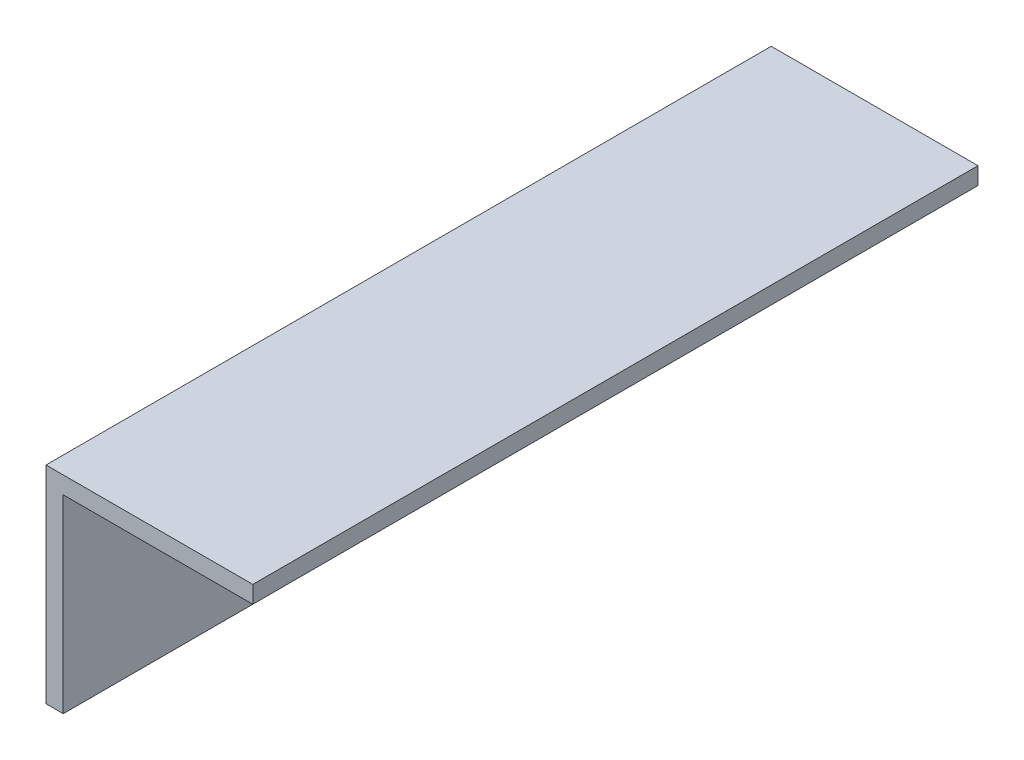
ISO-10303-21;
HEADER;
FILE_DESCRIPTION(('STEP AP214'),'2;1');
FILE_NAME('part.step','',(''),(''),'','','');
FILE_SCHEMA(('AUTOMOTIVE_DESIGN { 1 0 10303 214 1 1 1 1 }'));
ENDSEC;
DATA;
#1=APPLICATION_CONTEXT('core data for automotive mechanical design processes');
#2=APPLICATION_PROTOCOL_DEFINITION('international standard','automotive_design',2000,#1);
#3=PRODUCT_CONTEXT('',#1,'mechanical');
#4=PRODUCT('Part','Part','',(#3));
#5=PRODUCT_RELATED_PRODUCT_CATEGORY('part','',(#4));
#6=PRODUCT_DEFINITION_FORMATION('','',#4);
#7=PRODUCT_DEFINITION_CONTEXT('part definition',#1,'design');
#8=PRODUCT_DEFINITION('design','',#6,#7);
#9=PRODUCT_DEFINITION_SHAPE('','',#8);
#10=(LENGTH_UNIT() NAMED_UNIT(*) SI_UNIT(.MILLI.,.METRE.));
#11=(NAMED_UNIT(*) PLANE_ANGLE_UNIT() SI_UNIT($,.RADIAN.));
#12=(NAMED_UNIT(*) SI_UNIT($,.STERADIAN.) SOLID_ANGLE_UNIT());
#13=UNCERTAINTY_MEASURE_WITH_UNIT(LENGTH_MEASURE(1.E-05),#10,'distance_accuracy_value','');
#14=(GEOMETRIC_REPRESENTATION_CONTEXT(3) GLOBAL_UNCERTAINTY_ASSIGNED_CONTEXT((#13)) GLOBAL_UNIT_ASSIGNED_CONTEXT((#10,
#11,#12)) REPRESENTATION_CONTEXT('',''));
#15=CARTESIAN_POINT('',(0.,0.,0.));
#16=DIRECTION('',(0.,0.,1.));
#17=DIRECTION('',(1.,0.,0.));
#18=AXIS2_PLACEMENT_3D('',#15,#16,#17);
#19=CARTESIAN_POINT('',(19.05,19.05,66.802));
#20=DIRECTION('',(1.,0.,0.));
#21=DIRECTION('',(0.,0.,-1.));
#22=AXIS2_PLACEMENT_3D('',#19,#20,#21);
#23=PLANE('',#22);
#24=DIRECTION('',(0.,-1.,0.));
#25=VECTOR('',#24,1.);
#26=CARTESIAN_POINT('',(19.05,19.05,0.));
#27=LINE('',#26,#25);
#28=CARTESIAN_POINT('',(19.05,19.05,0.));
#29=VERTEX_POINT('',#28);
#30=CARTESIAN_POINT('',(19.05,17.4625,0.));
#31=VERTEX_POINT('',#30);
#32=EDGE_CURVE('E120',#29,#31,#27,.T.);
#33=ORIENTED_EDGE('',*,*,#32,.F.);
#34=DIRECTION('',(0.,0.,-1.));
#35=VECTOR('',#34,1.);
#36=CARTESIAN_POINT('',(19.05,19.05,66.802));
#37=LINE('',#36,#35);
#38=CARTESIAN_POINT('',(19.05,19.05,66.802));
#39=VERTEX_POINT('',#38);
#40=EDGE_CURVE('E11',#39,#29,#37,.T.);
#41=ORIENTED_EDGE('',*,*,#40,.F.);
#42=DIRECTION('',(0.,-1.,0.));
#43=VECTOR('',#42,1.);
#44=CARTESIAN_POINT('',(19.05,19.05,66.802));
#45=LINE('',#44,#43);
#46=CARTESIAN_POINT('',(19.05,17.4625,66.802));
#47=VERTEX_POINT('',#46);
#48=EDGE_CURVE('E134',#39,#47,#45,.T.);
#49=ORIENTED_EDGE('',*,*,#48,.T.);
#50=DIRECTION('',(0.,0.,-1.));
#51=VECTOR('',#50,1.);
#52=CARTESIAN_POINT('',(19.05,17.4625,66.802));
#53=LINE('',#52,#51);
#54=EDGE_CURVE('E38',#47,#31,#53,.T.);
#55=ORIENTED_EDGE('',*,*,#54,.T.);
#56=EDGE_LOOP('',(#33,#41,#49,#55));
#57=FACE_BOUND('',#56,.T.);
#58=ADVANCED_FACE('F35',(#57),#23,.T.);
#59=CARTESIAN_POINT('',(0.,19.05,66.802));
#60=DIRECTION('',(0.,1.,0.));
#61=DIRECTION('',(0.,0.,1.));
#62=AXIS2_PLACEMENT_3D('',#59,#60,#61);
#63=PLANE('',#62);
#64=DIRECTION('',(1.,0.,0.));
#65=VECTOR('',#64,1.);
#66=CARTESIAN_POINT('',(0.,19.05,0.));
#67=LINE('',#66,#65);
#68=CARTESIAN_POINT('',(0.,19.05,0.));
#69=VERTEX_POINT('',#68);
#70=EDGE_CURVE('E132',#69,#29,#67,.T.);
#71=ORIENTED_EDGE('',*,*,#70,.F.);
#72=DIRECTION('',(0.,0.,-1.));
#73=VECTOR('',#72,1.);
#74=CARTESIAN_POINT('',(0.,19.05,66.802));
#75=LINE('',#74,#73);
#76=CARTESIAN_POINT('',(0.,19.05,66.802));
#77=VERTEX_POINT('',#76);
#78=EDGE_CURVE('E44',#77,#69,#75,.T.);
#79=ORIENTED_EDGE('',*,*,#78,.F.);
#80=DIRECTION('',(1.,0.,0.));
#81=VECTOR('',#80,1.);
#82=CARTESIAN_POINT('',(0.,19.05,66.802));
#83=LINE('',#82,#81);
#84=EDGE_CURVE('E110',#77,#39,#83,.T.);
#85=ORIENTED_EDGE('',*,*,#84,.T.);
#86=ORIENTED_EDGE('',*,*,#40,.T.);
#87=EDGE_LOOP('',(#71,#79,#85,#86));
#88=FACE_BOUND('',#87,.T.);
#89=ADVANCED_FACE('F142',(#88),#63,.T.);
#90=CARTESIAN_POINT('',(0.,0.,66.802));
#91=DIRECTION('',(-1.,0.,0.));
#92=DIRECTION('',(0.,0.,1.));
#93=AXIS2_PLACEMENT_3D('',#90,#91,#92);
#94=PLANE('',#93);
#95=DIRECTION('',(0.,1.,0.));
#96=VECTOR('',#95,1.);
#97=CARTESIAN_POINT('',(0.,0.,0.));
#98=LINE('',#97,#96);
#99=CARTESIAN_POINT('',(0.,0.,0.));
#100=VERTEX_POINT('',#99);
#101=EDGE_CURVE('E97',#100,#69,#98,.T.);
#102=ORIENTED_EDGE('',*,*,#101,.F.);
#103=DIRECTION('',(0.,0.,-1.));
#104=VECTOR('',#103,1.);
#105=CARTESIAN_POINT('',(0.,0.,66.802));
#106=LINE('',#105,#104);
#107=CARTESIAN_POINT('',(0.,0.,66.802));
#108=VERTEX_POINT('',#107);
#109=EDGE_CURVE('E92',#108,#100,#106,.T.);
#110=ORIENTED_EDGE('',*,*,#109,.F.);
#111=DIRECTION('',(0.,1.,0.));
#112=VECTOR('',#111,1.);
#113=CARTESIAN_POINT('',(0.,0.,66.802));
#114=LINE('',#113,#112);
#115=EDGE_CURVE('E95',#108,#77,#114,.T.);
#116=ORIENTED_EDGE('',*,*,#115,.T.);
#117=ORIENTED_EDGE('',*,*,#78,.T.);
#118=EDGE_LOOP('',(#102,#110,#116,#117));
#119=FACE_BOUND('',#118,.T.);
#120=ADVANCED_FACE('F94',(#119),#94,.T.);
#121=CARTESIAN_POINT('',(1.5875,0.,66.802));
#122=DIRECTION('',(0.,-1.,0.));
#123=DIRECTION('',(0.,0.,-1.));
#124=AXIS2_PLACEMENT_3D('',#121,#122,#123);
#125=PLANE('',#124);
#126=DIRECTION('',(-1.,0.,0.));
#127=VECTOR('',#126,1.);
#128=CARTESIAN_POINT('',(1.5875,0.,0.));
#129=LINE('',#128,#127);
#130=CARTESIAN_POINT('',(1.5875,0.,0.));
#131=VERTEX_POINT('',#130);
#132=EDGE_CURVE('E129',#131,#100,#129,.T.);
#133=ORIENTED_EDGE('',*,*,#132,.F.);
#134=DIRECTION('',(0.,0.,-1.));
#135=VECTOR('',#134,1.);
#136=CARTESIAN_POINT('',(1.5875,0.,66.802));
#137=LINE('',#136,#135);
#138=CARTESIAN_POINT('',(1.5875,0.,66.802));
#139=VERTEX_POINT('',#138);
#140=EDGE_CURVE('E102',#139,#131,#137,.T.);
#141=ORIENTED_EDGE('',*,*,#140,.F.);
#142=DIRECTION('',(-1.,0.,0.));
#143=VECTOR('',#142,1.);
#144=CARTESIAN_POINT('',(1.5875,0.,66.802));
#145=LINE('',#144,#143);
#146=EDGE_CURVE('E108',#139,#108,#145,.T.);
#147=ORIENTED_EDGE('',*,*,#146,.T.);
#148=ORIENTED_EDGE('',*,*,#109,.T.);
#149=EDGE_LOOP('',(#133,#141,#147,#148));
#150=FACE_BOUND('',#149,.T.);
#151=ADVANCED_FACE('F112',(#150),#125,.T.);
#152=CARTESIAN_POINT('',(1.5875,17.4625,66.802));
#153=DIRECTION('',(1.,0.,0.));
#154=DIRECTION('',(0.,1.,0.));
#155=AXIS2_PLACEMENT_3D('',#152,#153,#154);
#156=PLANE('',#155);
#157=DIRECTION('',(0.,-1.,0.));
#158=VECTOR('',#157,1.);
#159=CARTESIAN_POINT('',(1.5875,17.4625,0.));
#160=LINE('',#159,#158);
#161=CARTESIAN_POINT('',(1.5875,17.4625,0.));
#162=VERTEX_POINT('',#161);
#163=EDGE_CURVE('E126',#162,#131,#160,.T.);
#164=ORIENTED_EDGE('',*,*,#163,.F.);
#165=DIRECTION('',(0.,0.,-1.));
#166=VECTOR('',#165,1.);
#167=CARTESIAN_POINT('',(1.5875,17.4625,66.802));
#168=LINE('',#167,#166);
#169=CARTESIAN_POINT('',(1.5875,17.4625,66.802));
#170=VERTEX_POINT('',#169);
#171=EDGE_CURVE('E137',#170,#162,#168,.T.);
#172=ORIENTED_EDGE('',*,*,#171,.F.);
#173=DIRECTION('',(0.,-1.,0.));
#174=VECTOR('',#173,1.);
#175=CARTESIAN_POINT('',(1.5875,17.4625,66.802));
#176=LINE('',#175,#174);
#177=EDGE_CURVE('E113',#170,#139,#176,.T.);
#178=ORIENTED_EDGE('',*,*,#177,.T.);
#179=ORIENTED_EDGE('',*,*,#140,.T.);
#180=EDGE_LOOP('',(#164,#172,#178,#179));
#181=FACE_BOUND('',#180,.T.);
#182=ADVANCED_FACE('F155',(#181),#156,.T.);
#183=CARTESIAN_POINT('',(19.05,17.4625,66.802));
#184=DIRECTION('',(0.,-1.,0.));
#185=DIRECTION('',(0.,0.,-1.));
#186=AXIS2_PLACEMENT_3D('',#183,#184,#185);
#187=PLANE('',#186);
#188=DIRECTION('',(-1.,0.,0.));
#189=VECTOR('',#188,1.);
#190=CARTESIAN_POINT('',(19.05,17.4625,0.));
#191=LINE('',#190,#189);
#192=EDGE_CURVE('E123',#31,#162,#191,.T.);
#193=ORIENTED_EDGE('',*,*,#192,.F.);
#194=ORIENTED_EDGE('',*,*,#54,.F.);
#195=DIRECTION('',(-1.,0.,0.));
#196=VECTOR('',#195,1.);
#197=CARTESIAN_POINT('',(19.05,17.4625,66.802));
#198=LINE('',#197,#196);
#199=EDGE_CURVE('E115',#47,#170,#198,.T.);
#200=ORIENTED_EDGE('',*,*,#199,.T.);
#201=ORIENTED_EDGE('',*,*,#171,.T.);
#202=EDGE_LOOP('',(#193,#194,#200,#201));
#203=FACE_BOUND('',#202,.T.);
#204=ADVANCED_FACE('F139',(#203),#187,.T.);
#205=CARTESIAN_POINT('',(0.,0.,66.802));
#206=DIRECTION('',(0.,0.,-1.));
#207=DIRECTION('',(-1.,0.,0.));
#208=AXIS2_PLACEMENT_3D('',#205,#206,#207);
#209=PLANE('',#208);
#210=ORIENTED_EDGE('',*,*,#48,.F.);
#211=ORIENTED_EDGE('',*,*,#84,.F.);
#212=ORIENTED_EDGE('',*,*,#115,.F.);
#213=ORIENTED_EDGE('',*,*,#146,.F.);
#214=ORIENTED_EDGE('',*,*,#177,.F.);
#215=ORIENTED_EDGE('',*,*,#199,.F.);
#216=EDGE_LOOP('',(#210,#211,#212,#213,#214,#215));
#217=FACE_BOUND('',#216,.T.);
#218=ADVANCED_FACE('F106',(#217),#209,.F.);
#219=CARTESIAN_POINT('',(0.,0.,0.));
#220=DIRECTION('',(0.,0.,-1.));
#221=DIRECTION('',(-1.,0.,0.));
#222=AXIS2_PLACEMENT_3D('',#219,#220,#221);
#223=PLANE('',#222);
#224=ORIENTED_EDGE('',*,*,#32,.T.);
#225=ORIENTED_EDGE('',*,*,#192,.T.);
#226=ORIENTED_EDGE('',*,*,#163,.T.);
#227=ORIENTED_EDGE('',*,*,#132,.T.);
#228=ORIENTED_EDGE('',*,*,#101,.T.);
#229=ORIENTED_EDGE('',*,*,#70,.T.);
#230=EDGE_LOOP('',(#224,#225,#226,#227,#228,#229));
#231=FACE_BOUND('',#230,.T.);
#232=ADVANCED_FACE('F141',(#231),#223,.T.);
#233=CLOSED_SHELL('',(#58,#89,#120,#151,#182,#204,#218,#232));
#234=MANIFOLD_SOLID_BREP('B2',#233);
#235=ADVANCED_BREP_SHAPE_REPRESENTATION('',(#18,#234),#14);
#236=SHAPE_DEFINITION_REPRESENTATION(#9,#235);
ENDSEC;
END-ISO-10303-21;
